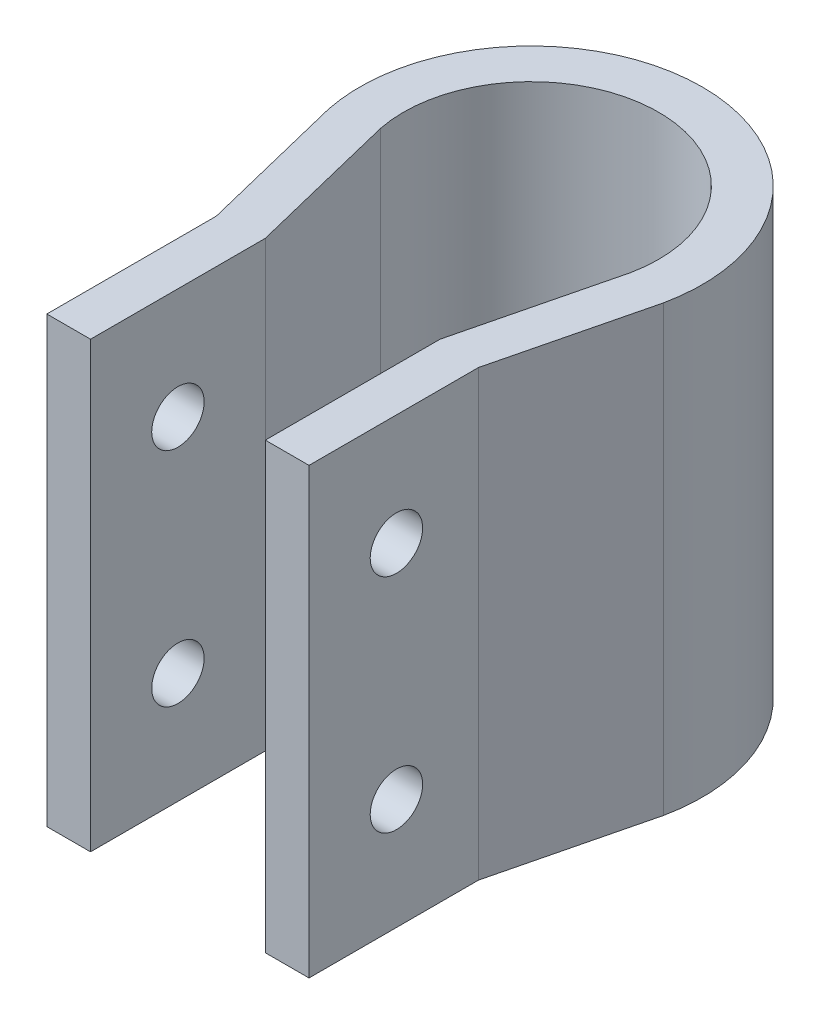
ISO-10303-21;
HEADER;
FILE_DESCRIPTION(('STEP AP214'),'2;1');
FILE_NAME('part.step','',(''),(''),'','','');
FILE_SCHEMA(('AUTOMOTIVE_DESIGN { 1 0 10303 214 1 1 1 1 }'));
ENDSEC;
DATA;
#1=APPLICATION_CONTEXT('core data for automotive mechanical design processes');
#2=APPLICATION_PROTOCOL_DEFINITION('international standard','automotive_design',2000,#1);
#3=PRODUCT_CONTEXT('',#1,'mechanical');
#4=PRODUCT('Part','Part','',(#3));
#5=PRODUCT_RELATED_PRODUCT_CATEGORY('part','',(#4));
#6=PRODUCT_DEFINITION_FORMATION('','',#4);
#7=PRODUCT_DEFINITION_CONTEXT('part definition',#1,'design');
#8=PRODUCT_DEFINITION('design','',#6,#7);
#9=PRODUCT_DEFINITION_SHAPE('','',#8);
#10=(LENGTH_UNIT() NAMED_UNIT(*) SI_UNIT(.MILLI.,.METRE.));
#11=(NAMED_UNIT(*) PLANE_ANGLE_UNIT() SI_UNIT($,.RADIAN.));
#12=(NAMED_UNIT(*) SI_UNIT($,.STERADIAN.) SOLID_ANGLE_UNIT());
#13=UNCERTAINTY_MEASURE_WITH_UNIT(LENGTH_MEASURE(1.E-05),#10,'distance_accuracy_value','');
#14=(GEOMETRIC_REPRESENTATION_CONTEXT(3) GLOBAL_UNCERTAINTY_ASSIGNED_CONTEXT((#13)) GLOBAL_UNIT_ASSIGNED_CONTEXT((#10,
#11,#12)) REPRESENTATION_CONTEXT('',''));
#15=CARTESIAN_POINT('',(0.,0.,0.));
#16=DIRECTION('',(0.,0.,1.));
#17=DIRECTION('',(1.,0.,0.));
#18=AXIS2_PLACEMENT_3D('',#15,#16,#17);
#19=CARTESIAN_POINT('',(-15.,318.77,40.405));
#20=DIRECTION('',(0.,0.,1.));
#21=DIRECTION('',(1.,0.,0.));
#22=AXIS2_PLACEMENT_3D('',#19,#20,#21);
#23=PLANE('',#22);
#24=DIRECTION('',(1.,0.,0.));
#25=VECTOR('',#24,1.);
#26=CARTESIAN_POINT('',(-15.,369.57,40.405));
#27=LINE('',#26,#25);
#28=CARTESIAN_POINT('',(-15.,369.57,40.405));
#29=VERTEX_POINT('',#28);
#30=CARTESIAN_POINT('',(-10.,369.57,40.405));
#31=VERTEX_POINT('',#30);
#32=EDGE_CURVE('E165',#29,#31,#27,.T.);
#33=ORIENTED_EDGE('',*,*,#32,.F.);
#34=DIRECTION('',(0.,1.,0.));
#35=VECTOR('',#34,1.);
#36=CARTESIAN_POINT('',(-15.,318.77,40.405));
#37=LINE('',#36,#35);
#38=CARTESIAN_POINT('',(-15.,318.77,40.405));
#39=VERTEX_POINT('',#38);
#40=EDGE_CURVE('E11',#39,#29,#37,.T.);
#41=ORIENTED_EDGE('',*,*,#40,.F.);
#42=DIRECTION('',(1.,0.,0.));
#43=VECTOR('',#42,1.);
#44=CARTESIAN_POINT('',(-15.,318.77,40.405));
#45=LINE('',#44,#43);
#46=CARTESIAN_POINT('',(-10.,318.77,40.405));
#47=VERTEX_POINT('',#46);
#48=EDGE_CURVE('E198',#39,#47,#45,.T.);
#49=ORIENTED_EDGE('',*,*,#48,.T.);
#50=DIRECTION('',(0.,1.,0.));
#51=VECTOR('',#50,1.);
#52=CARTESIAN_POINT('',(-10.,318.77,40.405));
#53=LINE('',#52,#51);
#54=EDGE_CURVE('E111',#47,#31,#53,.T.);
#55=ORIENTED_EDGE('',*,*,#54,.T.);
#56=EDGE_LOOP('',(#33,#41,#49,#55));
#57=FACE_BOUND('',#56,.T.);
#58=ADVANCED_FACE('F43',(#57),#23,.T.);
#59=CARTESIAN_POINT('',(-15.,318.77,40.405));
#60=DIRECTION('',(-1.,0.,0.));
#61=DIRECTION('',(0.,0.,1.));
#62=AXIS2_PLACEMENT_3D('',#59,#60,#61);
#63=PLANE('',#62);
#64=CARTESIAN_POINT('',(-15.,356.87,30.405));
#65=DIRECTION('',(-1.,0.,0.));
#66=DIRECTION('',(0.,0.,1.));
#67=AXIS2_PLACEMENT_3D('',#64,#65,#66);
#68=CIRCLE('',#67,3.);
#69=CARTESIAN_POINT('',(-15.,356.87,33.405));
#70=VERTEX_POINT('',#69);
#71=EDGE_CURVE('E219',#70,#70,#68,.T.);
#72=ORIENTED_EDGE('',*,*,#71,.F.);
#73=EDGE_LOOP('',(#72));
#74=FACE_BOUND('',#73,.T.);
#75=CARTESIAN_POINT('',(-15.,331.47,30.405));
#76=DIRECTION('',(-1.,0.,0.));
#77=DIRECTION('',(0.,0.,-1.));
#78=AXIS2_PLACEMENT_3D('',#75,#76,#77);
#79=CIRCLE('',#78,3.);
#80=CARTESIAN_POINT('',(-15.,331.47,27.405));
#81=VERTEX_POINT('',#80);
#82=EDGE_CURVE('E226',#81,#81,#79,.T.);
#83=ORIENTED_EDGE('',*,*,#82,.F.);
#84=EDGE_LOOP('',(#83));
#85=FACE_BOUND('',#84,.T.);
#86=DIRECTION('',(0.,0.,1.));
#87=VECTOR('',#86,1.);
#88=CARTESIAN_POINT('',(-15.,369.57,40.405));
#89=LINE('',#88,#87);
#90=CARTESIAN_POINT('',(-15.,369.57,21.0108095906005));
#91=VERTEX_POINT('',#90);
#92=EDGE_CURVE('E196',#91,#29,#89,.T.);
#93=ORIENTED_EDGE('',*,*,#92,.F.);
#94=DIRECTION('',(0.,1.,0.));
#95=VECTOR('',#94,1.);
#96=CARTESIAN_POINT('',(-15.,318.77,21.0108095906005));
#97=LINE('',#96,#95);
#98=CARTESIAN_POINT('',(-15.,318.77,21.0108095906005));
#99=VERTEX_POINT('',#98);
#100=EDGE_CURVE('E52',#99,#91,#97,.T.);
#101=ORIENTED_EDGE('',*,*,#100,.F.);
#102=DIRECTION('',(0.,0.,1.));
#103=VECTOR('',#102,1.);
#104=CARTESIAN_POINT('',(-15.,318.77,40.405));
#105=LINE('',#104,#103);
#106=EDGE_CURVE('E155',#99,#39,#105,.T.);
#107=ORIENTED_EDGE('',*,*,#106,.T.);
#108=ORIENTED_EDGE('',*,*,#40,.T.);
#109=EDGE_LOOP('',(#93,#101,#107,#108));
#110=FACE_BOUND('',#109,.T.);
#111=ADVANCED_FACE('F286',(#74,#85,#110),#63,.T.);
#112=CARTESIAN_POINT('',(-15.,318.77,21.0108095906005));
#113=DIRECTION('',(-0.971064360471332,0.,0.238817938652864));
#114=DIRECTION('',(0.238817938652864,0.,0.971064360471332));
#115=AXIS2_PLACEMENT_3D('',#112,#113,#114);
#116=PLANE('',#115);
#117=DIRECTION('',(0.238817938652864,0.,0.971064360471332));
#118=VECTOR('',#117,1.);
#119=CARTESIAN_POINT('',(-15.,369.57,21.0108095906005));
#120=LINE('',#119,#118);
#121=CARTESIAN_POINT('',(-19.1757924641354,369.57,4.03150199955395));
#122=VERTEX_POINT('',#121);
#123=EDGE_CURVE('E142',#122,#91,#120,.T.);
#124=ORIENTED_EDGE('',*,*,#123,.F.);
#125=DIRECTION('',(0.,1.,0.));
#126=VECTOR('',#125,1.);
#127=CARTESIAN_POINT('',(-19.1757924641354,318.77,4.03150199955395));
#128=LINE('',#127,#126);
#129=CARTESIAN_POINT('',(-19.1757924641354,318.77,4.03150199955395));
#130=VERTEX_POINT('',#129);
#131=EDGE_CURVE('E137',#130,#122,#128,.T.);
#132=ORIENTED_EDGE('',*,*,#131,.F.);
#133=DIRECTION('',(0.238817938652864,0.,0.971064360471332));
#134=VECTOR('',#133,1.);
#135=CARTESIAN_POINT('',(-15.,318.77,21.0108095906005));
#136=LINE('',#135,#134);
#137=EDGE_CURVE('E140',#130,#99,#136,.T.);
#138=ORIENTED_EDGE('',*,*,#137,.T.);
#139=ORIENTED_EDGE('',*,*,#100,.T.);
#140=EDGE_LOOP('',(#124,#132,#138,#139));
#141=FACE_BOUND('',#140,.T.);
#142=ADVANCED_FACE('F139',(#141),#116,.T.);
#143=CARTESIAN_POINT('',(0.,318.77,0.));
#144=DIRECTION('',(0.,1.,0.));
#145=DIRECTION('',(0.,0.,1.));
#146=AXIS2_PLACEMENT_3D('',#143,#144,#145);
#147=CYLINDRICAL_SURFACE('',#146,19.595);
#148=CARTESIAN_POINT('',(0.,369.57,0.));
#149=DIRECTION('',(0.,1.,0.));
#150=DIRECTION('',(0.,0.,-1.));
#151=AXIS2_PLACEMENT_3D('',#148,#149,#150);
#152=CIRCLE('',#151,19.595);
#153=CARTESIAN_POINT('',(19.1757924641354,369.57,4.03150199955394));
#154=VERTEX_POINT('',#153);
#155=EDGE_CURVE('E193',#154,#122,#152,.T.);
#156=ORIENTED_EDGE('',*,*,#155,.F.);
#157=DIRECTION('',(0.,1.,0.));
#158=VECTOR('',#157,1.);
#159=CARTESIAN_POINT('',(19.1757924641354,318.77,4.03150199955394));
#160=LINE('',#159,#158);
#161=CARTESIAN_POINT('',(19.1757924641354,318.77,4.03150199955394));
#162=VERTEX_POINT('',#161);
#163=EDGE_CURVE('E147',#162,#154,#160,.T.);
#164=ORIENTED_EDGE('',*,*,#163,.F.);
#165=CARTESIAN_POINT('',(0.,318.77,0.));
#166=DIRECTION('',(0.,1.,0.));
#167=DIRECTION('',(0.,0.,-1.));
#168=AXIS2_PLACEMENT_3D('',#165,#166,#167);
#169=CIRCLE('',#168,19.595);
#170=EDGE_CURVE('E153',#162,#130,#169,.T.);
#171=ORIENTED_EDGE('',*,*,#170,.T.);
#172=ORIENTED_EDGE('',*,*,#131,.T.);
#173=EDGE_LOOP('',(#156,#164,#171,#172));
#174=FACE_BOUND('',#173,.T.);
#175=ADVANCED_FACE('F157',(#174),#147,.T.);
#176=CARTESIAN_POINT('',(19.1757924641354,318.77,4.03150199955394));
#177=DIRECTION('',(0.971064360471332,0.,0.238817938652864));
#178=DIRECTION('',(0.238817938652864,0.,-0.971064360471332));
#179=AXIS2_PLACEMENT_3D('',#176,#177,#178);
#180=PLANE('',#179);
#181=DIRECTION('',(0.238817938652864,0.,-0.971064360471332));
#182=VECTOR('',#181,1.);
#183=CARTESIAN_POINT('',(19.1757924641354,369.57,4.03150199955394));
#184=LINE('',#183,#182);
#185=CARTESIAN_POINT('',(15.,369.57,21.0108095906005));
#186=VERTEX_POINT('',#185);
#187=EDGE_CURVE('E190',#186,#154,#184,.T.);
#188=ORIENTED_EDGE('',*,*,#187,.F.);
#189=DIRECTION('',(0.,1.,0.));
#190=VECTOR('',#189,1.);
#191=CARTESIAN_POINT('',(15.,318.77,21.0108095906005));
#192=LINE('',#191,#190);
#193=CARTESIAN_POINT('',(15.,318.77,21.0108095906005));
#194=VERTEX_POINT('',#193);
#195=EDGE_CURVE('E202',#194,#186,#192,.T.);
#196=ORIENTED_EDGE('',*,*,#195,.F.);
#197=DIRECTION('',(0.238817938652864,0.,-0.971064360471332));
#198=VECTOR('',#197,1.);
#199=CARTESIAN_POINT('',(19.1757924641354,318.77,4.03150199955394));
#200=LINE('',#199,#198);
#201=EDGE_CURVE('E158',#194,#162,#200,.T.);
#202=ORIENTED_EDGE('',*,*,#201,.T.);
#203=ORIENTED_EDGE('',*,*,#163,.T.);
#204=EDGE_LOOP('',(#188,#196,#202,#203));
#205=FACE_BOUND('',#204,.T.);
#206=ADVANCED_FACE('F302',(#205),#180,.T.);
#207=CARTESIAN_POINT('',(15.,318.77,21.0108095906005));
#208=DIRECTION('',(1.,0.,0.));
#209=DIRECTION('',(0.,0.,-1.));
#210=AXIS2_PLACEMENT_3D('',#207,#208,#209);
#211=PLANE('',#210);
#212=CARTESIAN_POINT('',(15.,356.87,30.405));
#213=DIRECTION('',(1.,0.,0.));
#214=DIRECTION('',(0.,0.,-1.));
#215=AXIS2_PLACEMENT_3D('',#212,#213,#214);
#216=CIRCLE('',#215,3.);
#217=CARTESIAN_POINT('',(15.,356.87,27.405));
#218=VERTEX_POINT('',#217);
#219=EDGE_CURVE('E169',#218,#218,#216,.T.);
#220=ORIENTED_EDGE('',*,*,#219,.F.);
#221=EDGE_LOOP('',(#220));
#222=FACE_BOUND('',#221,.T.);
#223=CARTESIAN_POINT('',(15.,331.47,30.405));
#224=DIRECTION('',(1.,0.,0.));
#225=DIRECTION('',(0.,0.,-1.));
#226=AXIS2_PLACEMENT_3D('',#223,#224,#225);
#227=CIRCLE('',#226,3.);
#228=CARTESIAN_POINT('',(15.,331.47,27.405));
#229=VERTEX_POINT('',#228);
#230=EDGE_CURVE('E223',#229,#229,#227,.T.);
#231=ORIENTED_EDGE('',*,*,#230,.F.);
#232=EDGE_LOOP('',(#231));
#233=FACE_BOUND('',#232,.T.);
#234=DIRECTION('',(0.,0.,-1.));
#235=VECTOR('',#234,1.);
#236=CARTESIAN_POINT('',(15.,369.57,21.0108095906005));
#237=LINE('',#236,#235);
#238=CARTESIAN_POINT('',(15.,369.57,40.405));
#239=VERTEX_POINT('',#238);
#240=EDGE_CURVE('E187',#239,#186,#237,.T.);
#241=ORIENTED_EDGE('',*,*,#240,.F.);
#242=DIRECTION('',(0.,1.,0.));
#243=VECTOR('',#242,1.);
#244=CARTESIAN_POINT('',(15.,318.77,40.405));
#245=LINE('',#244,#243);
#246=CARTESIAN_POINT('',(15.,318.77,40.405));
#247=VERTEX_POINT('',#246);
#248=EDGE_CURVE('E204',#247,#239,#245,.T.);
#249=ORIENTED_EDGE('',*,*,#248,.F.);
#250=DIRECTION('',(0.,0.,-1.));
#251=VECTOR('',#250,1.);
#252=CARTESIAN_POINT('',(15.,318.77,21.0108095906005));
#253=LINE('',#252,#251);
#254=EDGE_CURVE('E160',#247,#194,#253,.T.);
#255=ORIENTED_EDGE('',*,*,#254,.T.);
#256=ORIENTED_EDGE('',*,*,#195,.T.);
#257=EDGE_LOOP('',(#241,#249,#255,#256));
#258=FACE_BOUND('',#257,.T.);
#259=ADVANCED_FACE('F261',(#222,#233,#258),#211,.T.);
#260=CARTESIAN_POINT('',(10.,318.77,40.405));
#261=DIRECTION('',(0.,0.,1.));
#262=DIRECTION('',(1.,0.,0.));
#263=AXIS2_PLACEMENT_3D('',#260,#261,#262);
#264=PLANE('',#263);
#265=DIRECTION('',(1.,0.,0.));
#266=VECTOR('',#265,1.);
#267=CARTESIAN_POINT('',(10.,369.57,40.405));
#268=LINE('',#267,#266);
#269=CARTESIAN_POINT('',(10.,369.57,40.405));
#270=VERTEX_POINT('',#269);
#271=EDGE_CURVE('E184',#270,#239,#268,.T.);
#272=ORIENTED_EDGE('',*,*,#271,.F.);
#273=DIRECTION('',(0.,1.,0.));
#274=VECTOR('',#273,1.);
#275=CARTESIAN_POINT('',(10.,318.77,40.405));
#276=LINE('',#275,#274);
#277=CARTESIAN_POINT('',(10.,318.77,40.405));
#278=VERTEX_POINT('',#277);
#279=EDGE_CURVE('E206',#278,#270,#276,.T.);
#280=ORIENTED_EDGE('',*,*,#279,.F.);
#281=DIRECTION('',(1.,0.,0.));
#282=VECTOR('',#281,1.);
#283=CARTESIAN_POINT('',(10.,318.77,40.405));
#284=LINE('',#283,#282);
#285=EDGE_CURVE('E255',#278,#247,#284,.T.);
#286=ORIENTED_EDGE('',*,*,#285,.T.);
#287=ORIENTED_EDGE('',*,*,#248,.T.);
#288=EDGE_LOOP('',(#272,#280,#286,#287));
#289=FACE_BOUND('',#288,.T.);
#290=ADVANCED_FACE('F267',(#289),#264,.T.);
#291=CARTESIAN_POINT('',(10.,318.77,20.405));
#292=DIRECTION('',(-1.,0.,0.));
#293=DIRECTION('',(0.,0.,1.));
#294=AXIS2_PLACEMENT_3D('',#291,#292,#293);
#295=PLANE('',#294);
#296=CARTESIAN_POINT('',(10.,356.87,30.405));
#297=DIRECTION('',(-1.,0.,0.));
#298=DIRECTION('',(0.,0.,1.));
#299=AXIS2_PLACEMENT_3D('',#296,#297,#298);
#300=CIRCLE('',#299,3.);
#301=CARTESIAN_POINT('',(10.,356.87,33.405));
#302=VERTEX_POINT('',#301);
#303=EDGE_CURVE('E235',#302,#302,#300,.T.);
#304=ORIENTED_EDGE('',*,*,#303,.F.);
#305=EDGE_LOOP('',(#304));
#306=FACE_BOUND('',#305,.T.);
#307=CARTESIAN_POINT('',(10.,331.47,30.405));
#308=DIRECTION('',(-1.,0.,0.));
#309=DIRECTION('',(0.,0.,1.));
#310=AXIS2_PLACEMENT_3D('',#307,#308,#309);
#311=CIRCLE('',#310,3.);
#312=CARTESIAN_POINT('',(10.,331.47,33.405));
#313=VERTEX_POINT('',#312);
#314=EDGE_CURVE('E218',#313,#313,#311,.T.);
#315=ORIENTED_EDGE('',*,*,#314,.F.);
#316=EDGE_LOOP('',(#315));
#317=FACE_BOUND('',#316,.T.);
#318=DIRECTION('',(0.,0.,1.));
#319=VECTOR('',#318,1.);
#320=CARTESIAN_POINT('',(10.,369.57,20.405));
#321=LINE('',#320,#319);
#322=CARTESIAN_POINT('',(10.,369.57,20.405));
#323=VERTEX_POINT('',#322);
#324=EDGE_CURVE('E181',#323,#270,#321,.T.);
#325=ORIENTED_EDGE('',*,*,#324,.F.);
#326=DIRECTION('',(0.,1.,0.));
#327=VECTOR('',#326,1.);
#328=CARTESIAN_POINT('',(10.,318.77,20.405));
#329=LINE('',#328,#327);
#330=CARTESIAN_POINT('',(10.,318.77,20.405));
#331=VERTEX_POINT('',#330);
#332=EDGE_CURVE('E208',#331,#323,#329,.T.);
#333=ORIENTED_EDGE('',*,*,#332,.F.);
#334=DIRECTION('',(0.,0.,1.));
#335=VECTOR('',#334,1.);
#336=CARTESIAN_POINT('',(10.,318.77,20.405));
#337=LINE('',#336,#335);
#338=EDGE_CURVE('E252',#331,#278,#337,.T.);
#339=ORIENTED_EDGE('',*,*,#338,.T.);
#340=ORIENTED_EDGE('',*,*,#279,.T.);
#341=EDGE_LOOP('',(#325,#333,#339,#340));
#342=FACE_BOUND('',#341,.T.);
#343=ADVANCED_FACE('F270',(#306,#317,#342),#295,.T.);
#344=CARTESIAN_POINT('',(14.2987228957516,318.77,2.92584151151603));
#345=DIRECTION('',(-0.971064360471332,0.,-0.238817938652864));
#346=DIRECTION('',(-0.238817938652864,0.,0.971064360471332));
#347=AXIS2_PLACEMENT_3D('',#344,#345,#346);
#348=PLANE('',#347);
#349=DIRECTION('',(-0.238817938652864,0.,0.971064360471332));
#350=VECTOR('',#349,1.);
#351=CARTESIAN_POINT('',(14.2987228957516,369.57,2.92584151151603));
#352=LINE('',#351,#350);
#353=CARTESIAN_POINT('',(14.2987228957516,369.57,2.92584151151603));
#354=VERTEX_POINT('',#353);
#355=EDGE_CURVE('E178',#354,#323,#352,.T.);
#356=ORIENTED_EDGE('',*,*,#355,.F.);
#357=DIRECTION('',(0.,1.,0.));
#358=VECTOR('',#357,1.);
#359=CARTESIAN_POINT('',(14.2987228957516,318.77,2.92584151151603));
#360=LINE('',#359,#358);
#361=CARTESIAN_POINT('',(14.2987228957516,318.77,2.92584151151603));
#362=VERTEX_POINT('',#361);
#363=EDGE_CURVE('E210',#362,#354,#360,.T.);
#364=ORIENTED_EDGE('',*,*,#363,.F.);
#365=DIRECTION('',(-0.238817938652864,0.,0.971064360471332));
#366=VECTOR('',#365,1.);
#367=CARTESIAN_POINT('',(14.2987228957516,318.77,2.92584151151603));
#368=LINE('',#367,#366);
#369=EDGE_CURVE('E249',#362,#331,#368,.T.);
#370=ORIENTED_EDGE('',*,*,#369,.T.);
#371=ORIENTED_EDGE('',*,*,#332,.T.);
#372=EDGE_LOOP('',(#356,#364,#370,#371));
#373=FACE_BOUND('',#372,.T.);
#374=ADVANCED_FACE('F275',(#373),#348,.T.);
#375=CARTESIAN_POINT('',(0.,318.77,0.));
#376=DIRECTION('',(0.,1.,0.));
#377=DIRECTION('',(0.,0.,1.));
#378=AXIS2_PLACEMENT_3D('',#375,#376,#377);
#379=CYLINDRICAL_SURFACE('',#378,14.595);
#380=CARTESIAN_POINT('',(0.,369.57,0.));
#381=DIRECTION('',(0.,-1.,0.));
#382=DIRECTION('',(0.,0.,-1.));
#383=AXIS2_PLACEMENT_3D('',#380,#381,#382);
#384=CIRCLE('',#383,14.595);
#385=CARTESIAN_POINT('',(-14.2987228957516,369.57,2.92584151151603));
#386=VERTEX_POINT('',#385);
#387=EDGE_CURVE('E175',#386,#354,#384,.T.);
#388=ORIENTED_EDGE('',*,*,#387,.F.);
#389=DIRECTION('',(0.,1.,0.));
#390=VECTOR('',#389,1.);
#391=CARTESIAN_POINT('',(-14.2987228957516,318.77,2.92584151151603));
#392=LINE('',#391,#390);
#393=CARTESIAN_POINT('',(-14.2987228957516,318.77,2.92584151151603));
#394=VERTEX_POINT('',#393);
#395=EDGE_CURVE('E212',#394,#386,#392,.T.);
#396=ORIENTED_EDGE('',*,*,#395,.F.);
#397=CARTESIAN_POINT('',(0.,318.77,0.));
#398=DIRECTION('',(0.,-1.,0.));
#399=DIRECTION('',(0.,0.,-1.));
#400=AXIS2_PLACEMENT_3D('',#397,#398,#399);
#401=CIRCLE('',#400,14.595);
#402=EDGE_CURVE('E246',#394,#362,#401,.T.);
#403=ORIENTED_EDGE('',*,*,#402,.T.);
#404=ORIENTED_EDGE('',*,*,#363,.T.);
#405=EDGE_LOOP('',(#388,#396,#403,#404));
#406=FACE_BOUND('',#405,.T.);
#407=ADVANCED_FACE('F278',(#406),#379,.F.);
#408=CARTESIAN_POINT('',(-10.,318.77,20.405));
#409=DIRECTION('',(0.971064360471332,0.,-0.238817938652864));
#410=DIRECTION('',(-0.238817938652864,0.,-0.971064360471332));
#411=AXIS2_PLACEMENT_3D('',#408,#409,#410);
#412=PLANE('',#411);
#413=DIRECTION('',(-0.238817938652864,0.,-0.971064360471332));
#414=VECTOR('',#413,1.);
#415=CARTESIAN_POINT('',(-10.,369.57,20.405));
#416=LINE('',#415,#414);
#417=CARTESIAN_POINT('',(-10.,369.57,20.405));
#418=VERTEX_POINT('',#417);
#419=EDGE_CURVE('E172',#418,#386,#416,.T.);
#420=ORIENTED_EDGE('',*,*,#419,.F.);
#421=DIRECTION('',(0.,1.,0.));
#422=VECTOR('',#421,1.);
#423=CARTESIAN_POINT('',(-10.,318.77,20.405));
#424=LINE('',#423,#422);
#425=CARTESIAN_POINT('',(-10.,318.77,20.405));
#426=VERTEX_POINT('',#425);
#427=EDGE_CURVE('E214',#426,#418,#424,.T.);
#428=ORIENTED_EDGE('',*,*,#427,.F.);
#429=DIRECTION('',(-0.238817938652864,0.,-0.971064360471332));
#430=VECTOR('',#429,1.);
#431=CARTESIAN_POINT('',(-10.,318.77,20.405));
#432=LINE('',#431,#430);
#433=EDGE_CURVE('E243',#426,#394,#432,.T.);
#434=ORIENTED_EDGE('',*,*,#433,.T.);
#435=ORIENTED_EDGE('',*,*,#395,.T.);
#436=EDGE_LOOP('',(#420,#428,#434,#435));
#437=FACE_BOUND('',#436,.T.);
#438=ADVANCED_FACE('F282',(#437),#412,.T.);
#439=CARTESIAN_POINT('',(-10.,318.77,40.405));
#440=DIRECTION('',(1.,0.,0.));
#441=DIRECTION('',(0.,0.,-1.));
#442=AXIS2_PLACEMENT_3D('',#439,#440,#441);
#443=PLANE('',#442);
#444=CARTESIAN_POINT('',(-10.,356.87,30.405));
#445=DIRECTION('',(1.,0.,0.));
#446=DIRECTION('',(0.,0.,-1.));
#447=AXIS2_PLACEMENT_3D('',#444,#445,#446);
#448=CIRCLE('',#447,3.);
#449=CARTESIAN_POINT('',(-10.,356.87,27.405));
#450=VERTEX_POINT('',#449);
#451=EDGE_CURVE('E46',#450,#450,#448,.T.);
#452=ORIENTED_EDGE('',*,*,#451,.F.);
#453=EDGE_LOOP('',(#452));
#454=FACE_BOUND('',#453,.T.);
#455=CARTESIAN_POINT('',(-10.,331.47,30.405));
#456=DIRECTION('',(1.,0.,0.));
#457=DIRECTION('',(0.,0.,-1.));
#458=AXIS2_PLACEMENT_3D('',#455,#456,#457);
#459=CIRCLE('',#458,3.);
#460=CARTESIAN_POINT('',(-10.,331.47,27.405));
#461=VERTEX_POINT('',#460);
#462=EDGE_CURVE('E216',#461,#461,#459,.T.);
#463=ORIENTED_EDGE('',*,*,#462,.F.);
#464=EDGE_LOOP('',(#463));
#465=FACE_BOUND('',#464,.T.);
#466=DIRECTION('',(0.,0.,-1.));
#467=VECTOR('',#466,1.);
#468=CARTESIAN_POINT('',(-10.,369.57,40.405));
#469=LINE('',#468,#467);
#470=EDGE_CURVE('E168',#31,#418,#469,.T.);
#471=ORIENTED_EDGE('',*,*,#470,.F.);
#472=ORIENTED_EDGE('',*,*,#54,.F.);
#473=DIRECTION('',(0.,0.,-1.));
#474=VECTOR('',#473,1.);
#475=CARTESIAN_POINT('',(-10.,318.77,40.405));
#476=LINE('',#475,#474);
#477=EDGE_CURVE('E241',#47,#426,#476,.T.);
#478=ORIENTED_EDGE('',*,*,#477,.T.);
#479=ORIENTED_EDGE('',*,*,#427,.T.);
#480=EDGE_LOOP('',(#471,#472,#478,#479));
#481=FACE_BOUND('',#480,.T.);
#482=ADVANCED_FACE('F283',(#454,#465,#481),#443,.T.);
#483=CARTESIAN_POINT('',(0.,318.77,0.));
#484=DIRECTION('',(0.,-1.,0.));
#485=DIRECTION('',(0.,0.,-1.));
#486=AXIS2_PLACEMENT_3D('',#483,#484,#485);
#487=PLANE('',#486);
#488=ORIENTED_EDGE('',*,*,#48,.F.);
#489=ORIENTED_EDGE('',*,*,#106,.F.);
#490=ORIENTED_EDGE('',*,*,#137,.F.);
#491=ORIENTED_EDGE('',*,*,#170,.F.);
#492=ORIENTED_EDGE('',*,*,#201,.F.);
#493=ORIENTED_EDGE('',*,*,#254,.F.);
#494=ORIENTED_EDGE('',*,*,#285,.F.);
#495=ORIENTED_EDGE('',*,*,#338,.F.);
#496=ORIENTED_EDGE('',*,*,#369,.F.);
#497=ORIENTED_EDGE('',*,*,#402,.F.);
#498=ORIENTED_EDGE('',*,*,#433,.F.);
#499=ORIENTED_EDGE('',*,*,#477,.F.);
#500=EDGE_LOOP('',(#488,#489,#490,#491,#492,#493,#494,#495,#496,#497,#498,#499));
#501=FACE_BOUND('',#500,.T.);
#502=ADVANCED_FACE('F151',(#501),#487,.T.);
#503=CARTESIAN_POINT('',(0.,369.57,0.));
#504=DIRECTION('',(0.,-1.,0.));
#505=DIRECTION('',(0.,0.,-1.));
#506=AXIS2_PLACEMENT_3D('',#503,#504,#505);
#507=PLANE('',#506);
#508=ORIENTED_EDGE('',*,*,#32,.T.);
#509=ORIENTED_EDGE('',*,*,#470,.T.);
#510=ORIENTED_EDGE('',*,*,#419,.T.);
#511=ORIENTED_EDGE('',*,*,#387,.T.);
#512=ORIENTED_EDGE('',*,*,#355,.T.);
#513=ORIENTED_EDGE('',*,*,#324,.T.);
#514=ORIENTED_EDGE('',*,*,#271,.T.);
#515=ORIENTED_EDGE('',*,*,#240,.T.);
#516=ORIENTED_EDGE('',*,*,#187,.T.);
#517=ORIENTED_EDGE('',*,*,#155,.T.);
#518=ORIENTED_EDGE('',*,*,#123,.T.);
#519=ORIENTED_EDGE('',*,*,#92,.T.);
#520=EDGE_LOOP('',(#508,#509,#510,#511,#512,#513,#514,#515,#516,#517,#518,#519));
#521=FACE_BOUND('',#520,.T.);
#522=ADVANCED_FACE('F285',(#521),#507,.F.);
#523=CARTESIAN_POINT('',(19.595,331.47,30.405));
#524=DIRECTION('',(-1.,0.,0.));
#525=DIRECTION('',(0.,0.,1.));
#526=AXIS2_PLACEMENT_3D('',#523,#524,#525);
#527=CYLINDRICAL_SURFACE('',#526,3.);
#528=ORIENTED_EDGE('',*,*,#462,.T.);
#529=EDGE_LOOP('',(#528));
#530=FACE_BOUND('',#529,.T.);
#531=ORIENTED_EDGE('',*,*,#82,.T.);
#532=EDGE_LOOP('',(#531));
#533=FACE_BOUND('',#532,.T.);
#534=ADVANCED_FACE('F332',(#530,#533),#527,.F.);
#535=CARTESIAN_POINT('',(19.595,356.87,30.405));
#536=DIRECTION('',(-1.,0.,0.));
#537=DIRECTION('',(0.,0.,1.));
#538=AXIS2_PLACEMENT_3D('',#535,#536,#537);
#539=CYLINDRICAL_SURFACE('',#538,3.);
#540=ORIENTED_EDGE('',*,*,#451,.T.);
#541=EDGE_LOOP('',(#540));
#542=FACE_BOUND('',#541,.T.);
#543=ORIENTED_EDGE('',*,*,#71,.T.);
#544=EDGE_LOOP('',(#543));
#545=FACE_BOUND('',#544,.T.);
#546=ADVANCED_FACE('F329',(#542,#545),#539,.F.);
#547=ORIENTED_EDGE('',*,*,#230,.T.);
#548=EDGE_LOOP('',(#547));
#549=FACE_BOUND('',#548,.T.);
#550=ORIENTED_EDGE('',*,*,#314,.T.);
#551=EDGE_LOOP('',(#550));
#552=FACE_BOUND('',#551,.T.);
#553=ADVANCED_FACE('F331',(#549,#552),#527,.F.);
#554=ORIENTED_EDGE('',*,*,#219,.T.);
#555=EDGE_LOOP('',(#554));
#556=FACE_BOUND('',#555,.T.);
#557=ORIENTED_EDGE('',*,*,#303,.T.);
#558=EDGE_LOOP('',(#557));
#559=FACE_BOUND('',#558,.T.);
#560=ADVANCED_FACE('F334',(#556,#559),#539,.F.);
#561=CLOSED_SHELL('',(#58,#111,#142,#175,#206,#259,#290,#343,#374,#407,#438,#482,#502,#522,#534,
#546,#553,#560));
#562=MANIFOLD_SOLID_BREP('B2',#561);
#563=ADVANCED_BREP_SHAPE_REPRESENTATION('',(#18,#562),#14);
#564=SHAPE_DEFINITION_REPRESENTATION(#9,#563);
ENDSEC;
END-ISO-10303-21;
